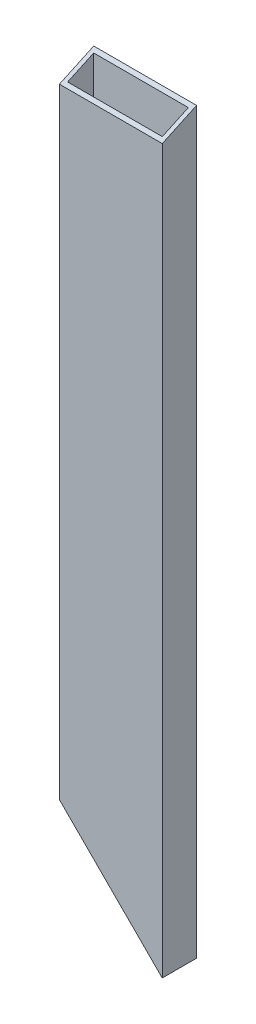
ISO-10303-21;
HEADER;
FILE_DESCRIPTION(('STEP AP214'),'2;1');
FILE_NAME('part.step','',(''),(''),'','','');
FILE_SCHEMA(('AUTOMOTIVE_DESIGN { 1 0 10303 214 1 1 1 1 }'));
ENDSEC;
DATA;
#1=APPLICATION_CONTEXT('core data for automotive mechanical design processes');
#2=APPLICATION_PROTOCOL_DEFINITION('international standard','automotive_design',2000,#1);
#3=PRODUCT_CONTEXT('',#1,'mechanical');
#4=PRODUCT('Part','Part','',(#3));
#5=PRODUCT_RELATED_PRODUCT_CATEGORY('part','',(#4));
#6=PRODUCT_DEFINITION_FORMATION('','',#4);
#7=PRODUCT_DEFINITION_CONTEXT('part definition',#1,'design');
#8=PRODUCT_DEFINITION('design','',#6,#7);
#9=PRODUCT_DEFINITION_SHAPE('','',#8);
#10=(LENGTH_UNIT() NAMED_UNIT(*) SI_UNIT(.MILLI.,.METRE.));
#11=(NAMED_UNIT(*) PLANE_ANGLE_UNIT() SI_UNIT($,.RADIAN.));
#12=(NAMED_UNIT(*) SI_UNIT($,.STERADIAN.) SOLID_ANGLE_UNIT());
#13=UNCERTAINTY_MEASURE_WITH_UNIT(LENGTH_MEASURE(1.E-05),#10,'distance_accuracy_value','');
#14=(GEOMETRIC_REPRESENTATION_CONTEXT(3) GLOBAL_UNCERTAINTY_ASSIGNED_CONTEXT((#13)) GLOBAL_UNIT_ASSIGNED_CONTEXT((#10,
#11,#12)) REPRESENTATION_CONTEXT('',''));
#15=CARTESIAN_POINT('',(0.,0.,0.));
#16=DIRECTION('',(0.,0.,1.));
#17=DIRECTION('',(1.,0.,0.));
#18=AXIS2_PLACEMENT_3D('',#15,#16,#17);
#19=CARTESIAN_POINT('',(-38.1,503.,-12.7));
#20=DIRECTION('',(1.,0.,0.));
#21=DIRECTION('',(0.,0.,-1.));
#22=AXIS2_PLACEMENT_3D('',#19,#20,#21);
#23=PLANE('',#22);
#24=DIRECTION('',(0.,-1.,0.));
#25=VECTOR('',#24,1.);
#26=CARTESIAN_POINT('',(-38.1,503.,12.7));
#27=LINE('',#26,#25);
#28=CARTESIAN_POINT('',(-38.1,497.108394772308,12.7));
#29=VERTEX_POINT('',#28);
#30=CARTESIAN_POINT('',(-38.1000000000001,38.1716033125994,12.7));
#31=VERTEX_POINT('',#30);
#32=EDGE_CURVE('E181',#29,#31,#27,.T.);
#33=ORIENTED_EDGE('',*,*,#32,.F.);
#34=DIRECTION('',(0.,0.420827858242928,-0.907140514874443));
#35=VECTOR('',#34,1.);
#36=CARTESIAN_POINT('',(-38.1000000000001,503.,0.));
#37=LINE('',#36,#35);
#38=CARTESIAN_POINT('',(-38.1,508.891605227692,-12.7));
#39=VERTEX_POINT('',#38);
#40=EDGE_CURVE('E161',#29,#39,#37,.T.);
#41=ORIENTED_EDGE('',*,*,#40,.T.);
#42=DIRECTION('',(0.,-1.,0.));
#43=VECTOR('',#42,1.);
#44=CARTESIAN_POINT('',(-38.1,503.,-12.7));
#45=LINE('',#44,#43);
#46=CARTESIAN_POINT('',(-38.1000000000001,38.1716033125994,-12.7));
#47=VERTEX_POINT('',#46);
#48=EDGE_CURVE('E184',#39,#47,#45,.T.);
#49=ORIENTED_EDGE('',*,*,#48,.T.);
#50=DIRECTION('',(0.,0.,1.));
#51=VECTOR('',#50,1.);
#52=CARTESIAN_POINT('',(-38.1,38.1716033125993,-12.7000000000001));
#53=LINE('',#52,#51);
#54=EDGE_CURVE('E203',#47,#31,#53,.T.);
#55=ORIENTED_EDGE('',*,*,#54,.T.);
#56=EDGE_LOOP('',(#33,#41,#49,#55));
#57=FACE_BOUND('',#56,.T.);
#58=ADVANCED_FACE('F91',(#57),#23,.F.);
#59=CARTESIAN_POINT('',(-38.1,503.,12.7));
#60=DIRECTION('',(0.,0.,-1.));
#61=DIRECTION('',(-1.,0.,0.));
#62=AXIS2_PLACEMENT_3D('',#59,#60,#61);
#63=PLANE('',#62);
#64=DIRECTION('',(0.,-1.,0.));
#65=VECTOR('',#64,1.);
#66=CARTESIAN_POINT('',(38.1,503.,12.7));
#67=LINE('',#66,#65);
#68=CARTESIAN_POINT('',(38.1,497.108394772308,12.7));
#69=VERTEX_POINT('',#68);
#70=CARTESIAN_POINT('',(38.1,-38.1,12.7));
#71=VERTEX_POINT('',#70);
#72=EDGE_CURVE('E172',#69,#71,#67,.T.);
#73=ORIENTED_EDGE('',*,*,#72,.F.);
#74=DIRECTION('',(-1.,0.,0.));
#75=VECTOR('',#74,1.);
#76=CARTESIAN_POINT('',(-38.1,497.108394772308,12.7));
#77=LINE('',#76,#75);
#78=EDGE_CURVE('E158',#69,#29,#77,.T.);
#79=ORIENTED_EDGE('',*,*,#78,.T.);
#80=ORIENTED_EDGE('',*,*,#32,.T.);
#81=DIRECTION('',(0.706442642378771,-0.707770296797555,0.));
#82=VECTOR('',#81,1.);
#83=CARTESIAN_POINT('',(-54.4850870664826,54.5874837258323,12.7));
#84=LINE('',#83,#82);
#85=CARTESIAN_POINT('',(38.0285310028063,-38.1,12.7000000000001));
#86=VERTEX_POINT('',#85);
#87=EDGE_CURVE('E192',#31,#86,#84,.T.);
#88=ORIENTED_EDGE('',*,*,#87,.T.);
#89=DIRECTION('',(-1.,0.,0.));
#90=VECTOR('',#89,1.);
#91=CARTESIAN_POINT('',(38.1,-38.1,12.7));
#92=LINE('',#91,#90);
#93=EDGE_CURVE('E180',#71,#86,#92,.T.);
#94=ORIENTED_EDGE('',*,*,#93,.F.);
#95=EDGE_LOOP('',(#73,#79,#80,#88,#94));
#96=FACE_BOUND('',#95,.T.);
#97=ADVANCED_FACE('F177',(#96),#63,.F.);
#98=CARTESIAN_POINT('',(38.1,503.,-12.7));
#99=DIRECTION('',(-1.,0.,0.));
#100=DIRECTION('',(0.,0.,1.));
#101=AXIS2_PLACEMENT_3D('',#98,#99,#100);
#102=PLANE('',#101);
#103=DIRECTION('',(0.,-1.,0.));
#104=VECTOR('',#103,1.);
#105=CARTESIAN_POINT('',(38.1,503.,-12.7));
#106=LINE('',#105,#104);
#107=CARTESIAN_POINT('',(38.1,508.891605227692,-12.7));
#108=VERTEX_POINT('',#107);
#109=CARTESIAN_POINT('',(38.1,-38.1,-12.7));
#110=VERTEX_POINT('',#109);
#111=EDGE_CURVE('E174',#108,#110,#106,.T.);
#112=ORIENTED_EDGE('',*,*,#111,.F.);
#113=DIRECTION('',(0.,0.420827858242927,-0.907140514874444));
#114=VECTOR('',#113,1.);
#115=CARTESIAN_POINT('',(38.1,503.,0.));
#116=LINE('',#115,#114);
#117=EDGE_CURVE('E105',#69,#108,#116,.T.);
#118=ORIENTED_EDGE('',*,*,#117,.F.);
#119=ORIENTED_EDGE('',*,*,#72,.T.);
#120=DIRECTION('',(0.,0.,1.));
#121=VECTOR('',#120,1.);
#122=CARTESIAN_POINT('',(38.1,-38.1,-12.7));
#123=LINE('',#122,#121);
#124=EDGE_CURVE('E201',#110,#71,#123,.T.);
#125=ORIENTED_EDGE('',*,*,#124,.F.);
#126=EDGE_LOOP('',(#112,#118,#119,#125));
#127=FACE_BOUND('',#126,.T.);
#128=ADVANCED_FACE('F170',(#127),#102,.F.);
#129=CARTESIAN_POINT('',(-38.1,503.,-12.7));
#130=DIRECTION('',(0.,0.,1.));
#131=DIRECTION('',(1.,0.,0.));
#132=AXIS2_PLACEMENT_3D('',#129,#130,#131);
#133=PLANE('',#132);
#134=ORIENTED_EDGE('',*,*,#48,.F.);
#135=DIRECTION('',(1.,0.,0.));
#136=VECTOR('',#135,1.);
#137=CARTESIAN_POINT('',(-38.1,508.891605227692,-12.7));
#138=LINE('',#137,#136);
#139=EDGE_CURVE('E166',#39,#108,#138,.T.);
#140=ORIENTED_EDGE('',*,*,#139,.T.);
#141=ORIENTED_EDGE('',*,*,#111,.T.);
#142=DIRECTION('',(1.,0.,0.));
#143=VECTOR('',#142,1.);
#144=CARTESIAN_POINT('',(-38.1,-38.1,-12.7));
#145=LINE('',#144,#143);
#146=CARTESIAN_POINT('',(38.0285310028063,-38.1,-12.7));
#147=VERTEX_POINT('',#146);
#148=EDGE_CURVE('E202',#147,#110,#145,.T.);
#149=ORIENTED_EDGE('',*,*,#148,.F.);
#150=DIRECTION('',(0.706442642378771,-0.707770296797555,0.));
#151=VECTOR('',#150,1.);
#152=CARTESIAN_POINT('',(-54.4850870664826,54.5874837258323,-12.7000000000001));
#153=LINE('',#152,#151);
#154=EDGE_CURVE('E165',#47,#147,#153,.T.);
#155=ORIENTED_EDGE('',*,*,#154,.F.);
#156=EDGE_LOOP('',(#134,#140,#141,#149,#155));
#157=FACE_BOUND('',#156,.T.);
#158=ADVANCED_FACE('F221',(#157),#133,.F.);
#159=CARTESIAN_POINT('',(-35.052,503.,-9.65199999999999));
#160=DIRECTION('',(1.,0.,0.));
#161=DIRECTION('',(0.,0.,-1.));
#162=AXIS2_PLACEMENT_3D('',#159,#160,#161);
#163=PLANE('',#162);
#164=DIRECTION('',(0.,0.420827858242927,-0.907140514874444));
#165=VECTOR('',#164,1.);
#166=CARTESIAN_POINT('',(-35.052,506.684651,-7.94266857528982));
#167=LINE('',#166,#165);
#168=CARTESIAN_POINT('',(-35.052,498.522380026954,9.652));
#169=VERTEX_POINT('',#168);
#170=CARTESIAN_POINT('',(-35.052,507.477619973046,-9.65199999999999));
#171=VERTEX_POINT('',#170);
#172=EDGE_CURVE('E112',#169,#171,#167,.T.);
#173=ORIENTED_EDGE('',*,*,#172,.F.);
#174=DIRECTION('',(0.,-1.,0.));
#175=VECTOR('',#174,1.);
#176=CARTESIAN_POINT('',(-35.052,503.,9.652));
#177=LINE('',#176,#175);
#178=CARTESIAN_POINT('',(-35.052,35.1178750475915,9.652));
#179=VERTEX_POINT('',#178);
#180=EDGE_CURVE('E217',#169,#179,#177,.T.);
#181=ORIENTED_EDGE('',*,*,#180,.T.);
#182=DIRECTION('',(0.,0.,1.));
#183=VECTOR('',#182,1.);
#184=CARTESIAN_POINT('',(-35.052,35.1178750475915,-9.65200000000024));
#185=LINE('',#184,#183);
#186=CARTESIAN_POINT('',(-35.052,35.1178750475915,-9.65199999999999));
#187=VERTEX_POINT('',#186);
#188=EDGE_CURVE('E206',#187,#179,#185,.T.);
#189=ORIENTED_EDGE('',*,*,#188,.F.);
#190=DIRECTION('',(0.,-1.,0.));
#191=VECTOR('',#190,1.);
#192=CARTESIAN_POINT('',(-35.052,503.,-9.65199999999999));
#193=LINE('',#192,#191);
#194=EDGE_CURVE('E211',#171,#187,#193,.T.);
#195=ORIENTED_EDGE('',*,*,#194,.F.);
#196=EDGE_LOOP('',(#173,#181,#189,#195));
#197=FACE_BOUND('',#196,.T.);
#198=ADVANCED_FACE('F253',(#197),#163,.T.);
#199=CARTESIAN_POINT('',(-35.052,503.,9.652));
#200=DIRECTION('',(0.,0.,-1.));
#201=DIRECTION('',(-1.,0.,0.));
#202=AXIS2_PLACEMENT_3D('',#199,#200,#201);
#203=PLANE('',#202);
#204=DIRECTION('',(-1.,0.,0.));
#205=VECTOR('',#204,1.);
#206=CARTESIAN_POINT('',(-35.052,498.522380026954,9.652));
#207=LINE('',#206,#205);
#208=CARTESIAN_POINT('',(35.052,498.522380026955,9.65199999999999));
#209=VERTEX_POINT('',#208);
#210=EDGE_CURVE('E245',#209,#169,#207,.T.);
#211=ORIENTED_EDGE('',*,*,#210,.F.);
#212=DIRECTION('',(0.,-1.,0.));
#213=VECTOR('',#212,1.);
#214=CARTESIAN_POINT('',(35.052,503.,9.65199999999999));
#215=LINE('',#214,#213);
#216=CARTESIAN_POINT('',(35.052,-35.1178750475911,9.65199999999999));
#217=VERTEX_POINT('',#216);
#218=EDGE_CURVE('E215',#209,#217,#215,.T.);
#219=ORIENTED_EDGE('',*,*,#218,.T.);
#220=DIRECTION('',(0.706442642378771,-0.707770296797555,0.));
#221=VECTOR('',#220,1.);
#222=CARTESIAN_POINT('',(-268.992650116188,269.498182001048,9.65200000000003));
#223=LINE('',#222,#221);
#224=EDGE_CURVE('E230',#179,#217,#223,.T.);
#225=ORIENTED_EDGE('',*,*,#224,.F.);
#226=ORIENTED_EDGE('',*,*,#180,.F.);
#227=EDGE_LOOP('',(#211,#219,#225,#226));
#228=FACE_BOUND('',#227,.T.);
#229=ADVANCED_FACE('F243',(#228),#203,.T.);
#230=CARTESIAN_POINT('',(35.052,503.,-9.652));
#231=DIRECTION('',(-1.,0.,0.));
#232=DIRECTION('',(0.,0.,1.));
#233=AXIS2_PLACEMENT_3D('',#230,#231,#232);
#234=PLANE('',#233);
#235=DIRECTION('',(0.,-0.420827858242927,0.907140514874444));
#236=VECTOR('',#235,1.);
#237=CARTESIAN_POINT('',(35.052,506.684651,-7.94266857528983));
#238=LINE('',#237,#236);
#239=CARTESIAN_POINT('',(35.052,507.477619973046,-9.652));
#240=VERTEX_POINT('',#239);
#241=EDGE_CURVE('E249',#240,#209,#238,.T.);
#242=ORIENTED_EDGE('',*,*,#241,.F.);
#243=DIRECTION('',(0.,-1.,0.));
#244=VECTOR('',#243,1.);
#245=CARTESIAN_POINT('',(35.052,503.,-9.652));
#246=LINE('',#245,#244);
#247=CARTESIAN_POINT('',(35.052,-35.117875047591,-9.652));
#248=VERTEX_POINT('',#247);
#249=EDGE_CURVE('E213',#240,#248,#246,.T.);
#250=ORIENTED_EDGE('',*,*,#249,.T.);
#251=DIRECTION('',(0.,0.,-1.));
#252=VECTOR('',#251,1.);
#253=CARTESIAN_POINT('',(35.052,-35.1178750475911,-9.65200000000028));
#254=LINE('',#253,#252);
#255=EDGE_CURVE('E227',#217,#248,#254,.T.);
#256=ORIENTED_EDGE('',*,*,#255,.F.);
#257=ORIENTED_EDGE('',*,*,#218,.F.);
#258=EDGE_LOOP('',(#242,#250,#256,#257));
#259=FACE_BOUND('',#258,.T.);
#260=ADVANCED_FACE('F248',(#259),#234,.T.);
#261=CARTESIAN_POINT('',(-35.052,503.,-9.65199999999999));
#262=DIRECTION('',(0.,0.,1.));
#263=DIRECTION('',(1.,0.,0.));
#264=AXIS2_PLACEMENT_3D('',#261,#262,#263);
#265=PLANE('',#264);
#266=DIRECTION('',(1.,0.,0.));
#267=VECTOR('',#266,1.);
#268=CARTESIAN_POINT('',(-35.052,507.477619973046,-9.65199999999999));
#269=LINE('',#268,#267);
#270=EDGE_CURVE('E12',#171,#240,#269,.T.);
#271=ORIENTED_EDGE('',*,*,#270,.F.);
#272=ORIENTED_EDGE('',*,*,#194,.T.);
#273=DIRECTION('',(-0.706442642378771,0.707770296797555,0.));
#274=VECTOR('',#273,1.);
#275=CARTESIAN_POINT('',(-268.992650116188,269.498182001048,-9.65199999999996));
#276=LINE('',#275,#274);
#277=EDGE_CURVE('E198',#248,#187,#276,.T.);
#278=ORIENTED_EDGE('',*,*,#277,.F.);
#279=ORIENTED_EDGE('',*,*,#249,.F.);
#280=EDGE_LOOP('',(#271,#272,#278,#279));
#281=FACE_BOUND('',#280,.T.);
#282=ADVANCED_FACE('F252',(#281),#265,.T.);
#283=CARTESIAN_POINT('',(0.,-38.1,0.));
#284=DIRECTION('',(0.,-1.,0.));
#285=DIRECTION('',(0.,0.,-1.));
#286=AXIS2_PLACEMENT_3D('',#283,#284,#285);
#287=PLANE('',#286);
#288=DIRECTION('',(0.,0.,1.));
#289=VECTOR('',#288,1.);
#290=CARTESIAN_POINT('',(38.0285310028063,-38.1,0.));
#291=LINE('',#290,#289);
#292=EDGE_CURVE('E98',#147,#86,#291,.T.);
#293=ORIENTED_EDGE('',*,*,#292,.F.);
#294=ORIENTED_EDGE('',*,*,#148,.T.);
#295=ORIENTED_EDGE('',*,*,#124,.T.);
#296=ORIENTED_EDGE('',*,*,#93,.T.);
#297=EDGE_LOOP('',(#293,#294,#295,#296));
#298=FACE_BOUND('',#297,.T.);
#299=ADVANCED_FACE('F200',(#298),#287,.T.);
#300=CARTESIAN_POINT('',(-54.4850870664826,54.5874837258323,12.7));
#301=DIRECTION('',(0.707770296797555,0.706442642378771,0.));
#302=DIRECTION('',(-0.706442642378771,0.707770296797555,0.));
#303=AXIS2_PLACEMENT_3D('',#300,#301,#302);
#304=PLANE('',#303);
#305=ORIENTED_EDGE('',*,*,#188,.T.);
#306=ORIENTED_EDGE('',*,*,#224,.T.);
#307=ORIENTED_EDGE('',*,*,#255,.T.);
#308=ORIENTED_EDGE('',*,*,#277,.T.);
#309=EDGE_LOOP('',(#305,#306,#307,#308));
#310=FACE_BOUND('',#309,.T.);
#311=ORIENTED_EDGE('',*,*,#154,.T.);
#312=ORIENTED_EDGE('',*,*,#292,.T.);
#313=ORIENTED_EDGE('',*,*,#87,.F.);
#314=ORIENTED_EDGE('',*,*,#54,.F.);
#315=EDGE_LOOP('',(#311,#312,#313,#314));
#316=FACE_BOUND('',#315,.T.);
#317=ADVANCED_FACE('F190',(#310,#316),#304,.F.);
#318=CARTESIAN_POINT('',(-38.1000000000001,503.,0.));
#319=DIRECTION('',(0.,-0.907140514874444,-0.420827858242927));
#320=DIRECTION('',(0.,0.420827858242927,-0.907140514874444));
#321=AXIS2_PLACEMENT_3D('',#318,#319,#320);
#322=PLANE('',#321);
#323=ORIENTED_EDGE('',*,*,#172,.T.);
#324=ORIENTED_EDGE('',*,*,#270,.T.);
#325=ORIENTED_EDGE('',*,*,#241,.T.);
#326=ORIENTED_EDGE('',*,*,#210,.T.);
#327=EDGE_LOOP('',(#323,#324,#325,#326));
#328=FACE_BOUND('',#327,.T.);
#329=ORIENTED_EDGE('',*,*,#117,.T.);
#330=ORIENTED_EDGE('',*,*,#139,.F.);
#331=ORIENTED_EDGE('',*,*,#40,.F.);
#332=ORIENTED_EDGE('',*,*,#78,.F.);
#333=EDGE_LOOP('',(#329,#330,#331,#332));
#334=FACE_BOUND('',#333,.T.);
#335=ADVANCED_FACE('F159',(#328,#334),#322,.F.);
#336=CLOSED_SHELL('',(#58,#97,#128,#158,#198,#229,#260,#282,#299,#317,#335));
#337=MANIFOLD_SOLID_BREP('B2',#336);
#338=ADVANCED_BREP_SHAPE_REPRESENTATION('',(#18,#337),#14);
#339=SHAPE_DEFINITION_REPRESENTATION(#9,#338);
ENDSEC;
END-ISO-10303-21;
